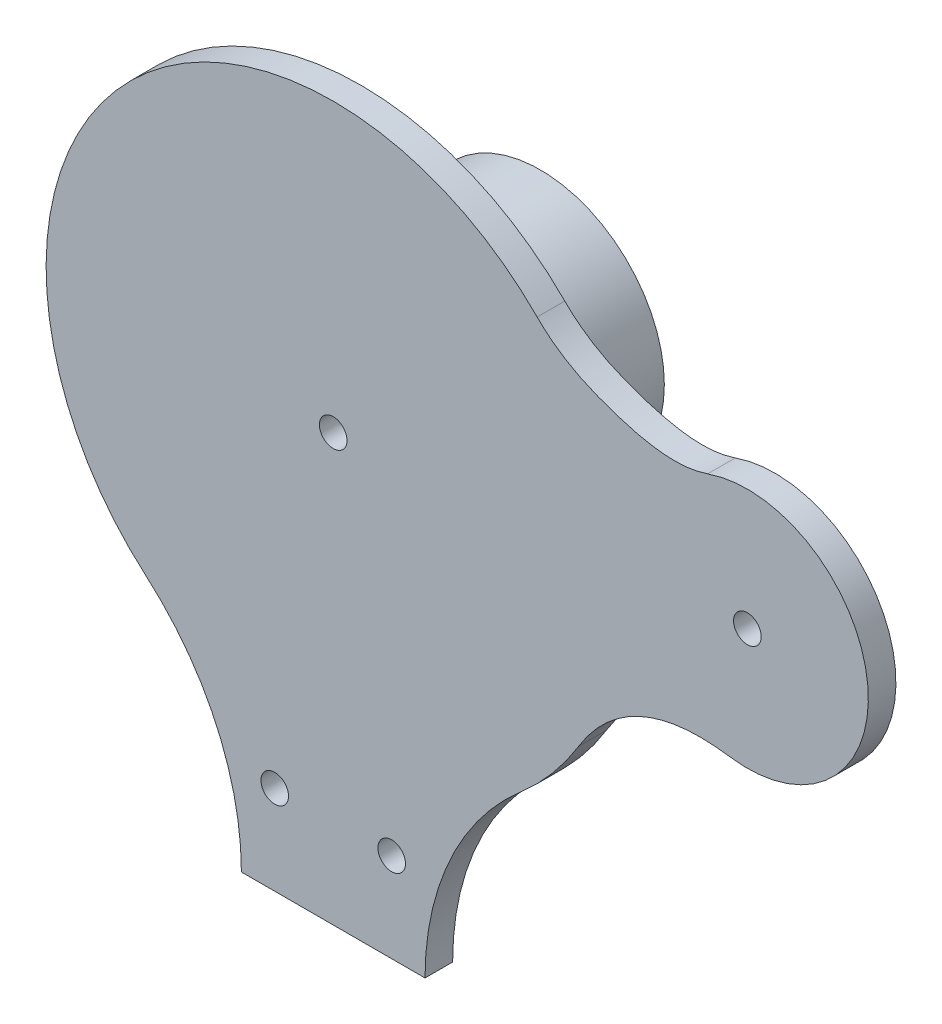
ISO-10303-21;
HEADER;
FILE_DESCRIPTION(('STEP AP214'),'2;1');
FILE_NAME('part.step','',(''),(''),'','','');
FILE_SCHEMA(('AUTOMOTIVE_DESIGN { 1 0 10303 214 1 1 1 1 }'));
ENDSEC;
DATA;
#1=APPLICATION_CONTEXT('core data for automotive mechanical design processes');
#2=APPLICATION_PROTOCOL_DEFINITION('international standard','automotive_design',2000,#1);
#3=PRODUCT_CONTEXT('',#1,'mechanical');
#4=PRODUCT('Part','Part','',(#3));
#5=PRODUCT_RELATED_PRODUCT_CATEGORY('part','',(#4));
#6=PRODUCT_DEFINITION_FORMATION('','',#4);
#7=PRODUCT_DEFINITION_CONTEXT('part definition',#1,'design');
#8=PRODUCT_DEFINITION('design','',#6,#7);
#9=PRODUCT_DEFINITION_SHAPE('','',#8);
#10=(LENGTH_UNIT() NAMED_UNIT(*) SI_UNIT(.MILLI.,.METRE.));
#11=(NAMED_UNIT(*) PLANE_ANGLE_UNIT() SI_UNIT($,.RADIAN.));
#12=(NAMED_UNIT(*) SI_UNIT($,.STERADIAN.) SOLID_ANGLE_UNIT());
#13=UNCERTAINTY_MEASURE_WITH_UNIT(LENGTH_MEASURE(1.E-05),#10,'distance_accuracy_value','');
#14=(GEOMETRIC_REPRESENTATION_CONTEXT(3) GLOBAL_UNCERTAINTY_ASSIGNED_CONTEXT((#13)) GLOBAL_UNIT_ASSIGNED_CONTEXT((#10,
#11,#12)) REPRESENTATION_CONTEXT('',''));
#15=CARTESIAN_POINT('',(0.,0.,0.));
#16=DIRECTION('',(0.,0.,1.));
#17=DIRECTION('',(1.,0.,0.));
#18=AXIS2_PLACEMENT_3D('',#15,#16,#17);
#19=CARTESIAN_POINT('',(0.,-52.8237291338587,5.08));
#20=DIRECTION('',(0.,0.,-1.));
#21=DIRECTION('',(-1.,0.,0.));
#22=AXIS2_PLACEMENT_3D('',#19,#20,#21);
#23=CYLINDRICAL_SURFACE('',#22,52.8237291338587);
#24=DIRECTION('',(0.,0.,1.));
#25=VECTOR('',#24,1.);
#26=CARTESIAN_POINT('',(37.5245833339332,-15.6450792764207,-88.7850163484781));
#27=LINE('',#26,#25);
#28=CARTESIAN_POINT('',(37.5245833339332,-15.6450792764207,0.));
#29=VERTEX_POINT('',#28);
#30=CARTESIAN_POINT('',(37.5245833339332,-15.6450792764207,5.08));
#31=VERTEX_POINT('',#30);
#32=EDGE_CURVE('E147',#29,#31,#27,.T.);
#33=ORIENTED_EDGE('',*,*,#32,.F.);
#34=CARTESIAN_POINT('',(0.,-52.8237291338587,0.));
#35=DIRECTION('',(0.,0.,1.));
#36=DIRECTION('',(1.,0.,0.));
#37=AXIS2_PLACEMENT_3D('',#34,#35,#36);
#38=CIRCLE('',#37,52.8237291338587);
#39=CARTESIAN_POINT('',(-34.5064888002731,-92.819336271192,0.));
#40=VERTEX_POINT('',#39);
#41=EDGE_CURVE('E187',#29,#40,#38,.T.);
#42=ORIENTED_EDGE('',*,*,#41,.T.);
#43=DIRECTION('',(0.,0.,-1.));
#44=VECTOR('',#43,1.);
#45=CARTESIAN_POINT('',(-34.5064888002731,-92.819336271192,5.08));
#46=LINE('',#45,#44);
#47=CARTESIAN_POINT('',(-34.5064888002731,-92.819336271192,5.08));
#48=VERTEX_POINT('',#47);
#49=EDGE_CURVE('E182',#48,#40,#46,.T.);
#50=ORIENTED_EDGE('',*,*,#49,.F.);
#51=CARTESIAN_POINT('',(0.,-52.8237291338587,5.08));
#52=DIRECTION('',(0.,0.,1.));
#53=DIRECTION('',(1.,0.,0.));
#54=AXIS2_PLACEMENT_3D('',#51,#52,#53);
#55=CIRCLE('',#54,52.8237291338587);
#56=EDGE_CURVE('E48',#31,#48,#55,.T.);
#57=ORIENTED_EDGE('',*,*,#56,.F.);
#58=EDGE_LOOP('',(#33,#42,#50,#57));
#59=FACE_BOUND('',#58,.T.);
#60=ADVANCED_FACE('F32',(#59),#23,.T.);
#61=CARTESIAN_POINT('',(-67.691,-131.282672273614,5.08));
#62=DIRECTION('',(0.,0.,1.));
#63=DIRECTION('',(1.,0.,0.));
#64=AXIS2_PLACEMENT_3D('',#61,#62,#63);
#65=PLANE('',#64);
#66=CARTESIAN_POINT('',(76.2,-45.9724694607301,5.08));
#67=DIRECTION('',(0.,0.,1.));
#68=DIRECTION('',(1.,0.,0.));
#69=AXIS2_PLACEMENT_3D('',#66,#67,#68);
#70=CIRCLE('',#69,2.54);
#71=CARTESIAN_POINT('',(78.74,-45.9724694607301,5.08));
#72=VERTEX_POINT('',#71);
#73=EDGE_CURVE('E127',#72,#72,#70,.T.);
#74=ORIENTED_EDGE('',*,*,#73,.F.);
#75=EDGE_LOOP('',(#74));
#76=FACE_BOUND('',#75,.T.);
#77=CARTESIAN_POINT('',(-1.22818422099158E-12,-52.8237291338587,5.08));
#78=DIRECTION('',(0.,0.,-1.));
#79=DIRECTION('',(-1.,0.,0.));
#80=AXIS2_PLACEMENT_3D('',#77,#78,#79);
#81=CIRCLE('',#80,2.54);
#82=CARTESIAN_POINT('',(-2.54000000000123,-52.8237291338587,5.08));
#83=VERTEX_POINT('',#82);
#84=EDGE_CURVE('E153',#83,#83,#81,.T.);
#85=ORIENTED_EDGE('',*,*,#84,.T.);
#86=EDGE_LOOP('',(#85));
#87=FACE_BOUND('',#86,.T.);
#88=CARTESIAN_POINT('',(-10.7564051785917,-114.872047192808,5.08));
#89=DIRECTION('',(0.,0.,1.));
#90=DIRECTION('',(1.,0.,0.));
#91=AXIS2_PLACEMENT_3D('',#88,#89,#90);
#92=CIRCLE('',#91,2.54);
#93=CARTESIAN_POINT('',(-8.2164051785917,-114.872047192808,5.08));
#94=VERTEX_POINT('',#93);
#95=EDGE_CURVE('E168',#94,#94,#92,.T.);
#96=ORIENTED_EDGE('',*,*,#95,.F.);
#97=EDGE_LOOP('',(#96));
#98=FACE_BOUND('',#97,.T.);
#99=CARTESIAN_POINT('',(-67.691,-131.282672273614,5.08));
#100=DIRECTION('',(0.,0.,-1.));
#101=DIRECTION('',(1.,0.,0.));
#102=AXIS2_PLACEMENT_3D('',#99,#100,#101);
#103=CIRCLE('',#102,50.8);
#104=CARTESIAN_POINT('',(-16.891,-131.282672273614,5.08));
#105=VERTEX_POINT('',#104);
#106=EDGE_CURVE('E174',#48,#105,#103,.T.);
#107=ORIENTED_EDGE('',*,*,#106,.T.);
#108=DIRECTION('',(1.,0.,0.));
#109=VECTOR('',#108,1.);
#110=CARTESIAN_POINT('',(-16.891,-131.282672273614,5.08));
#111=LINE('',#110,#109);
#112=CARTESIAN_POINT('',(16.891,-131.282672273614,5.08));
#113=VERTEX_POINT('',#112);
#114=EDGE_CURVE('E176',#105,#113,#111,.T.);
#115=ORIENTED_EDGE('',*,*,#114,.T.);
#116=CARTESIAN_POINT('',(67.691,-131.282672273614,5.08));
#117=DIRECTION('',(0.,0.,-1.));
#118=DIRECTION('',(1.,0.,0.));
#119=AXIS2_PLACEMENT_3D('',#116,#117,#118);
#120=CIRCLE('',#119,50.8);
#121=CARTESIAN_POINT('',(34.5064888002731,-92.819336271192,5.08));
#122=VERTEX_POINT('',#121);
#123=EDGE_CURVE('E179',#113,#122,#120,.T.);
#124=ORIENTED_EDGE('',*,*,#123,.T.);
#125=CARTESIAN_POINT('',(45.1618112271935,-80.2236774237117,5.08));
#126=VERTEX_POINT('',#125);
#127=EDGE_CURVE('E124',#122,#126,#55,.T.);
#128=ORIENTED_EDGE('',*,*,#127,.T.);
#129=CARTESIAN_POINT('',(45.1618112271935,-80.2236774237117,5.08));
#130=CARTESIAN_POINT('',(47.5743131665912,-76.2472846210777,5.08));
#131=CARTESIAN_POINT('',(55.0333885756071,-68.6406887311446,5.08));
#132=CARTESIAN_POINT('',(65.5082150756756,-66.9035385878799,5.08));
#133=CARTESIAN_POINT('',(72.9914132998963,-67.9938641825907,5.08));
#134=B_SPLINE_CURVE_WITH_KNOTS('',3,(#129,#130,#131,#132,#133),.UNSPECIFIED.,.F.,.F.,(4,1,4),
(0.,0.395495140914109,1.),.UNSPECIFIED.);
#135=CARTESIAN_POINT('',(72.9914132998962,-67.9938641825907,5.08));
#136=VERTEX_POINT('',#135);
#137=EDGE_CURVE('E105',#126,#136,#134,.T.);
#138=ORIENTED_EDGE('',*,*,#137,.T.);
#139=CARTESIAN_POINT('',(76.2,-45.9724694607301,5.08));
#140=DIRECTION('',(0.,0.,1.));
#141=DIRECTION('',(1.,0.,0.));
#142=AXIS2_PLACEMENT_3D('',#139,#140,#141);
#143=CIRCLE('',#142,22.2539177249327);
#144=CARTESIAN_POINT('',(68.9001800028994,-24.9498748987355,5.08));
#145=VERTEX_POINT('',#144);
#146=EDGE_CURVE('E114',#136,#145,#143,.T.);
#147=ORIENTED_EDGE('',*,*,#146,.T.);
#148=CARTESIAN_POINT('',(68.9001800028994,-24.9498748987355,5.08));
#149=CARTESIAN_POINT('',(63.2971972314928,-26.8954371154976,5.08));
#150=CARTESIAN_POINT('',(51.3897080482479,-24.415182371124,5.08));
#151=CARTESIAN_POINT('',(41.5692824440602,-19.7274128038788,5.08));
#152=CARTESIAN_POINT('',(37.5245833339332,-15.6450792764207,5.08));
#153=B_SPLINE_CURVE_WITH_KNOTS('',3,(#148,#149,#150,#151,#152),.UNSPECIFIED.,.F.,.F.,(4,1,4),
(0.,0.520070066682019,1.),.UNSPECIFIED.);
#154=EDGE_CURVE('E111',#145,#31,#153,.T.);
#155=ORIENTED_EDGE('',*,*,#154,.T.);
#156=ORIENTED_EDGE('',*,*,#56,.T.);
#157=EDGE_LOOP('',(#107,#115,#124,#128,#138,#147,#155,#156));
#158=FACE_BOUND('',#157,.T.);
#159=CARTESIAN_POINT('',(10.7564051785917,-114.872047192808,5.08));
#160=DIRECTION('',(0.,0.,1.));
#161=DIRECTION('',(1.,0.,0.));
#162=AXIS2_PLACEMENT_3D('',#159,#160,#161);
#163=CIRCLE('',#162,2.53999999999999);
#164=CARTESIAN_POINT('',(13.2964051785917,-114.872047192808,5.08));
#165=VERTEX_POINT('',#164);
#166=EDGE_CURVE('E162',#165,#165,#163,.T.);
#167=ORIENTED_EDGE('',*,*,#166,.F.);
#168=EDGE_LOOP('',(#167));
#169=FACE_BOUND('',#168,.T.);
#170=ADVANCED_FACE('F122',(#76,#87,#98,#158,#169),#65,.T.);
#171=CARTESIAN_POINT('',(-67.691,-131.282672273614,0.));
#172=DIRECTION('',(0.,0.,1.));
#173=DIRECTION('',(1.,0.,0.));
#174=AXIS2_PLACEMENT_3D('',#171,#172,#173);
#175=PLANE('',#174);
#176=CARTESIAN_POINT('',(76.2,-45.9724694607301,0.));
#177=DIRECTION('',(0.,0.,1.));
#178=DIRECTION('',(1.,0.,0.));
#179=AXIS2_PLACEMENT_3D('',#176,#177,#178);
#180=CIRCLE('',#179,2.54);
#181=CARTESIAN_POINT('',(78.74,-45.9724694607301,0.));
#182=VERTEX_POINT('',#181);
#183=EDGE_CURVE('E36',#182,#182,#180,.T.);
#184=ORIENTED_EDGE('',*,*,#183,.T.);
#185=EDGE_LOOP('',(#184));
#186=FACE_BOUND('',#185,.T.);
#187=CARTESIAN_POINT('',(-1.22818422099158E-12,-52.8237291338587,0.));
#188=DIRECTION('',(0.,0.,1.));
#189=DIRECTION('',(1.,0.,0.));
#190=AXIS2_PLACEMENT_3D('',#187,#188,#189);
#191=CIRCLE('',#190,22.8255294525079);
#192=CARTESIAN_POINT('',(22.8255294525067,-52.8237291338587,0.));
#193=VERTEX_POINT('',#192);
#194=EDGE_CURVE('E11',#193,#193,#191,.F.);
#195=ORIENTED_EDGE('',*,*,#194,.F.);
#196=EDGE_LOOP('',(#195));
#197=FACE_BOUND('',#196,.T.);
#198=DIRECTION('',(1.,0.,0.));
#199=VECTOR('',#198,1.);
#200=CARTESIAN_POINT('',(-16.891,-131.282672273614,0.));
#201=LINE('',#200,#199);
#202=CARTESIAN_POINT('',(-16.891,-131.282672273614,0.));
#203=VERTEX_POINT('',#202);
#204=CARTESIAN_POINT('',(16.891,-131.282672273614,0.));
#205=VERTEX_POINT('',#204);
#206=EDGE_CURVE('E171',#203,#205,#201,.T.);
#207=ORIENTED_EDGE('',*,*,#206,.F.);
#208=CARTESIAN_POINT('',(-67.691,-131.282672273614,0.));
#209=DIRECTION('',(0.,0.,-1.));
#210=DIRECTION('',(1.,0.,0.));
#211=AXIS2_PLACEMENT_3D('',#208,#209,#210);
#212=CIRCLE('',#211,50.8);
#213=EDGE_CURVE('E177',#40,#203,#212,.T.);
#214=ORIENTED_EDGE('',*,*,#213,.F.);
#215=ORIENTED_EDGE('',*,*,#41,.F.);
#216=CARTESIAN_POINT('',(68.9001800028994,-24.9498748987355,0.));
#217=CARTESIAN_POINT('',(63.2971972314928,-26.8954371154976,0.));
#218=CARTESIAN_POINT('',(51.3897080482479,-24.415182371124,0.));
#219=CARTESIAN_POINT('',(41.5692824440602,-19.7274128038788,0.));
#220=CARTESIAN_POINT('',(37.5245833339332,-15.6450792764207,0.));
#221=B_SPLINE_CURVE_WITH_KNOTS('',3,(#216,#217,#218,#219,#220),.UNSPECIFIED.,.F.,.F.,(4,1,4),
(0.,0.520070066682019,1.),.UNSPECIFIED.);
#222=CARTESIAN_POINT('',(68.9001800028994,-24.9498748987355,0.));
#223=VERTEX_POINT('',#222);
#224=EDGE_CURVE('E146',#29,#223,#221,.F.);
#225=ORIENTED_EDGE('',*,*,#224,.T.);
#226=CARTESIAN_POINT('',(76.2,-45.9724694607301,0.));
#227=DIRECTION('',(0.,0.,1.));
#228=DIRECTION('',(1.,0.,0.));
#229=AXIS2_PLACEMENT_3D('',#226,#227,#228);
#230=CIRCLE('',#229,22.2539177249327);
#231=CARTESIAN_POINT('',(72.9914132998962,-67.9938641825907,0.));
#232=VERTEX_POINT('',#231);
#233=EDGE_CURVE('E150',#223,#232,#230,.F.);
#234=ORIENTED_EDGE('',*,*,#233,.T.);
#235=CARTESIAN_POINT('',(45.1618112271935,-80.2236774237117,0.));
#236=CARTESIAN_POINT('',(47.5743131665912,-76.2472846210777,0.));
#237=CARTESIAN_POINT('',(55.0333885756071,-68.6406887311446,0.));
#238=CARTESIAN_POINT('',(65.5082150756756,-66.9035385878799,0.));
#239=CARTESIAN_POINT('',(72.9914132998963,-67.9938641825907,0.));
#240=B_SPLINE_CURVE_WITH_KNOTS('',3,(#235,#236,#237,#238,#239),.UNSPECIFIED.,.F.,.F.,(4,1,4),
(0.,0.395495140914109,1.),.UNSPECIFIED.);
#241=CARTESIAN_POINT('',(45.1618112271935,-80.2236774237117,0.));
#242=VERTEX_POINT('',#241);
#243=EDGE_CURVE('E107',#232,#242,#240,.F.);
#244=ORIENTED_EDGE('',*,*,#243,.T.);
#245=CARTESIAN_POINT('',(34.5064888002731,-92.819336271192,0.));
#246=VERTEX_POINT('',#245);
#247=EDGE_CURVE('E188',#246,#242,#38,.T.);
#248=ORIENTED_EDGE('',*,*,#247,.F.);
#249=CARTESIAN_POINT('',(67.691,-131.282672273614,0.));
#250=DIRECTION('',(0.,0.,-1.));
#251=DIRECTION('',(1.,0.,0.));
#252=AXIS2_PLACEMENT_3D('',#249,#250,#251);
#253=CIRCLE('',#252,50.8);
#254=EDGE_CURVE('E185',#205,#246,#253,.T.);
#255=ORIENTED_EDGE('',*,*,#254,.F.);
#256=EDGE_LOOP('',(#207,#214,#215,#225,#234,#244,#248,#255));
#257=FACE_BOUND('',#256,.T.);
#258=CARTESIAN_POINT('',(-10.7564051785917,-114.872047192808,0.));
#259=DIRECTION('',(0.,0.,1.));
#260=DIRECTION('',(1.,0.,0.));
#261=AXIS2_PLACEMENT_3D('',#258,#259,#260);
#262=CIRCLE('',#261,2.54);
#263=CARTESIAN_POINT('',(-8.2164051785917,-114.872047192808,0.));
#264=VERTEX_POINT('',#263);
#265=EDGE_CURVE('E165',#264,#264,#262,.T.);
#266=ORIENTED_EDGE('',*,*,#265,.T.);
#267=EDGE_LOOP('',(#266));
#268=FACE_BOUND('',#267,.T.);
#269=CARTESIAN_POINT('',(10.7564051785917,-114.872047192808,0.));
#270=DIRECTION('',(0.,0.,1.));
#271=DIRECTION('',(1.,0.,0.));
#272=AXIS2_PLACEMENT_3D('',#269,#270,#271);
#273=CIRCLE('',#272,2.53999999999999);
#274=CARTESIAN_POINT('',(13.2964051785917,-114.872047192808,0.));
#275=VERTEX_POINT('',#274);
#276=EDGE_CURVE('E161',#275,#275,#273,.T.);
#277=ORIENTED_EDGE('',*,*,#276,.T.);
#278=EDGE_LOOP('',(#277));
#279=FACE_BOUND('',#278,.T.);
#280=ADVANCED_FACE('F209',(#186,#197,#257,#268,#279),#175,.F.);
#281=CARTESIAN_POINT('',(-16.891,-131.282672273614,5.08));
#282=DIRECTION('',(0.,1.,0.));
#283=DIRECTION('',(-1.,0.,0.));
#284=AXIS2_PLACEMENT_3D('',#281,#282,#283);
#285=PLANE('',#284);
#286=ORIENTED_EDGE('',*,*,#206,.T.);
#287=DIRECTION('',(0.,0.,-1.));
#288=VECTOR('',#287,1.);
#289=CARTESIAN_POINT('',(16.891,-131.282672273614,5.08));
#290=LINE('',#289,#288);
#291=EDGE_CURVE('E196',#113,#205,#290,.T.);
#292=ORIENTED_EDGE('',*,*,#291,.F.);
#293=ORIENTED_EDGE('',*,*,#114,.F.);
#294=DIRECTION('',(0.,0.,-1.));
#295=VECTOR('',#294,1.);
#296=CARTESIAN_POINT('',(-16.891,-131.282672273614,5.08));
#297=LINE('',#296,#295);
#298=EDGE_CURVE('E41',#105,#203,#297,.T.);
#299=ORIENTED_EDGE('',*,*,#298,.T.);
#300=EDGE_LOOP('',(#286,#292,#293,#299));
#301=FACE_BOUND('',#300,.T.);
#302=ADVANCED_FACE('F34',(#301),#285,.F.);
#303=CARTESIAN_POINT('',(67.691,-131.282672273614,5.08));
#304=DIRECTION('',(0.,0.,-1.));
#305=DIRECTION('',(-1.,0.,0.));
#306=AXIS2_PLACEMENT_3D('',#303,#304,#305);
#307=CYLINDRICAL_SURFACE('',#306,50.8);
#308=ORIENTED_EDGE('',*,*,#254,.T.);
#309=DIRECTION('',(0.,0.,-1.));
#310=VECTOR('',#309,1.);
#311=CARTESIAN_POINT('',(34.5064888002731,-92.819336271192,5.08));
#312=LINE('',#311,#310);
#313=EDGE_CURVE('E193',#122,#246,#312,.T.);
#314=ORIENTED_EDGE('',*,*,#313,.F.);
#315=ORIENTED_EDGE('',*,*,#123,.F.);
#316=ORIENTED_EDGE('',*,*,#291,.T.);
#317=EDGE_LOOP('',(#308,#314,#315,#316));
#318=FACE_BOUND('',#317,.T.);
#319=ADVANCED_FACE('F214',(#318),#307,.F.);
#320=ORIENTED_EDGE('',*,*,#247,.T.);
#321=DIRECTION('',(0.,0.,1.));
#322=VECTOR('',#321,1.);
#323=CARTESIAN_POINT('',(45.1618112271935,-80.2236774237117,-88.7850163484781));
#324=LINE('',#323,#322);
#325=EDGE_CURVE('E56',#242,#126,#324,.T.);
#326=ORIENTED_EDGE('',*,*,#325,.T.);
#327=ORIENTED_EDGE('',*,*,#127,.F.);
#328=ORIENTED_EDGE('',*,*,#313,.T.);
#329=EDGE_LOOP('',(#320,#326,#327,#328));
#330=FACE_BOUND('',#329,.T.);
#331=ADVANCED_FACE('F216',(#330),#23,.T.);
#332=CARTESIAN_POINT('',(-67.691,-131.282672273614,5.08));
#333=DIRECTION('',(0.,0.,-1.));
#334=DIRECTION('',(-1.,0.,0.));
#335=AXIS2_PLACEMENT_3D('',#332,#333,#334);
#336=CYLINDRICAL_SURFACE('',#335,50.8);
#337=ORIENTED_EDGE('',*,*,#213,.T.);
#338=ORIENTED_EDGE('',*,*,#298,.F.);
#339=ORIENTED_EDGE('',*,*,#106,.F.);
#340=ORIENTED_EDGE('',*,*,#49,.T.);
#341=EDGE_LOOP('',(#337,#338,#339,#340));
#342=FACE_BOUND('',#341,.T.);
#343=ADVANCED_FACE('F206',(#342),#336,.F.);
#344=CARTESIAN_POINT('',(-10.7564051785917,-114.872047192808,5.08));
#345=DIRECTION('',(0.,0.,-1.));
#346=DIRECTION('',(-1.,0.,0.));
#347=AXIS2_PLACEMENT_3D('',#344,#345,#346);
#348=CYLINDRICAL_SURFACE('',#347,2.54);
#349=ORIENTED_EDGE('',*,*,#95,.T.);
#350=EDGE_LOOP('',(#349));
#351=FACE_BOUND('',#350,.T.);
#352=ORIENTED_EDGE('',*,*,#265,.F.);
#353=EDGE_LOOP('',(#352));
#354=FACE_BOUND('',#353,.T.);
#355=ADVANCED_FACE('F254',(#351,#354),#348,.F.);
#356=CARTESIAN_POINT('',(10.7564051785917,-114.872047192808,5.08));
#357=DIRECTION('',(0.,0.,-1.));
#358=DIRECTION('',(-1.,0.,0.));
#359=AXIS2_PLACEMENT_3D('',#356,#357,#358);
#360=CYLINDRICAL_SURFACE('',#359,2.53999999999999);
#361=ORIENTED_EDGE('',*,*,#166,.T.);
#362=EDGE_LOOP('',(#361));
#363=FACE_BOUND('',#362,.T.);
#364=ORIENTED_EDGE('',*,*,#276,.F.);
#365=EDGE_LOOP('',(#364));
#366=FACE_BOUND('',#365,.T.);
#367=ADVANCED_FACE('F250',(#363,#366),#360,.F.);
#368=CARTESIAN_POINT('',(-1.22818422099158E-12,-52.8237291338587,-33.02));
#369=DIRECTION('',(0.,0.,1.));
#370=DIRECTION('',(1.,0.,0.));
#371=AXIS2_PLACEMENT_3D('',#368,#369,#370);
#372=CYLINDRICAL_SURFACE('',#371,22.8255294525079);
#373=CARTESIAN_POINT('',(-1.22818422099158E-12,-52.8237291338587,-33.02));
#374=DIRECTION('',(0.,0.,-1.));
#375=DIRECTION('',(-1.,0.,0.));
#376=AXIS2_PLACEMENT_3D('',#373,#374,#375);
#377=CIRCLE('',#376,22.8255294525079);
#378=CARTESIAN_POINT('',(-22.8255294525091,-52.8237291338587,-33.02));
#379=VERTEX_POINT('',#378);
#380=EDGE_CURVE('E156',#379,#379,#377,.T.);
#381=ORIENTED_EDGE('',*,*,#380,.F.);
#382=EDGE_LOOP('',(#381));
#383=FACE_BOUND('',#382,.T.);
#384=ORIENTED_EDGE('',*,*,#194,.T.);
#385=EDGE_LOOP('',(#384));
#386=FACE_BOUND('',#385,.T.);
#387=ADVANCED_FACE('F246',(#383,#386),#372,.T.);
#388=CARTESIAN_POINT('',(-1.22818422099158E-12,-52.8237291338587,-33.02));
#389=DIRECTION('',(0.,0.,-1.));
#390=DIRECTION('',(-1.,0.,0.));
#391=AXIS2_PLACEMENT_3D('',#388,#389,#390);
#392=PLANE('',#391);
#393=CARTESIAN_POINT('',(-1.22818422099158E-12,-52.8237291338587,-33.02));
#394=DIRECTION('',(0.,0.,-1.));
#395=DIRECTION('',(-1.,0.,0.));
#396=AXIS2_PLACEMENT_3D('',#393,#394,#395);
#397=CIRCLE('',#396,2.54);
#398=CARTESIAN_POINT('',(-2.54000000000123,-52.8237291338587,-33.02));
#399=VERTEX_POINT('',#398);
#400=EDGE_CURVE('E152',#399,#399,#397,.T.);
#401=ORIENTED_EDGE('',*,*,#400,.F.);
#402=EDGE_LOOP('',(#401));
#403=FACE_BOUND('',#402,.T.);
#404=ORIENTED_EDGE('',*,*,#380,.T.);
#405=EDGE_LOOP('',(#404));
#406=FACE_BOUND('',#405,.T.);
#407=ADVANCED_FACE('F242',(#403,#406),#392,.T.);
#408=CARTESIAN_POINT('',(-1.22818422099158E-12,-52.8237291338587,5.08));
#409=DIRECTION('',(0.,0.,-1.));
#410=DIRECTION('',(-1.,0.,0.));
#411=AXIS2_PLACEMENT_3D('',#408,#409,#410);
#412=CYLINDRICAL_SURFACE('',#411,2.54);
#413=ORIENTED_EDGE('',*,*,#84,.F.);
#414=EDGE_LOOP('',(#413));
#415=FACE_BOUND('',#414,.T.);
#416=ORIENTED_EDGE('',*,*,#400,.T.);
#417=EDGE_LOOP('',(#416));
#418=FACE_BOUND('',#417,.T.);
#419=ADVANCED_FACE('F238',(#415,#418),#412,.F.);
#420=CARTESIAN_POINT('',(45.1618112271935,-80.2236774237117,-88.7850163484781));
#421=CARTESIAN_POINT('',(47.5743131665912,-76.2472846210777,-88.7850163484781));
#422=CARTESIAN_POINT('',(55.0333885756071,-68.6406887311446,-88.7850163484781));
#423=CARTESIAN_POINT('',(65.5082150756756,-66.9035385878799,-88.7850163484781));
#424=CARTESIAN_POINT('',(72.9914132998963,-67.9938641825907,-88.7850163484781));
#425=B_SPLINE_CURVE_WITH_KNOTS('',3,(#420,#421,#422,#423,#424),.UNSPECIFIED.,.F.,.F.,(4,1,4),
(0.,0.395495140914109,1.),.UNSPECIFIED.);
#426=DIRECTION('',(0.,0.,1.));
#427=VECTOR('',#426,1.);
#428=SURFACE_OF_LINEAR_EXTRUSION('',#425,#427);
#429=ORIENTED_EDGE('',*,*,#243,.F.);
#430=DIRECTION('',(0.,0.,1.));
#431=VECTOR('',#430,1.);
#432=CARTESIAN_POINT('',(72.9914132998962,-67.9938641825907,-88.7850163484781));
#433=LINE('',#432,#431);
#434=EDGE_CURVE('E101',#232,#136,#433,.T.);
#435=ORIENTED_EDGE('',*,*,#434,.T.);
#436=ORIENTED_EDGE('',*,*,#137,.F.);
#437=ORIENTED_EDGE('',*,*,#325,.F.);
#438=EDGE_LOOP('',(#429,#435,#436,#437));
#439=FACE_BOUND('',#438,.T.);
#440=ADVANCED_FACE('F103',(#439),#428,.T.);
#441=CARTESIAN_POINT('',(68.9001800028994,-24.9498748987355,-88.7850163484781));
#442=CARTESIAN_POINT('',(63.2971972314928,-26.8954371154976,-88.7850163484781));
#443=CARTESIAN_POINT('',(51.3897080482479,-24.415182371124,-88.7850163484781));
#444=CARTESIAN_POINT('',(41.5692824440602,-19.7274128038788,-88.7850163484781));
#445=CARTESIAN_POINT('',(37.5245833339332,-15.6450792764207,-88.7850163484781));
#446=B_SPLINE_CURVE_WITH_KNOTS('',3,(#441,#442,#443,#444,#445),.UNSPECIFIED.,.F.,.F.,(4,1,4),
(0.,0.520070066682019,1.),.UNSPECIFIED.);
#447=DIRECTION('',(0.,0.,1.));
#448=VECTOR('',#447,1.);
#449=SURFACE_OF_LINEAR_EXTRUSION('',#446,#448);
#450=ORIENTED_EDGE('',*,*,#224,.F.);
#451=ORIENTED_EDGE('',*,*,#32,.T.);
#452=ORIENTED_EDGE('',*,*,#154,.F.);
#453=DIRECTION('',(0.,0.,1.));
#454=VECTOR('',#453,1.);
#455=CARTESIAN_POINT('',(68.9001800028994,-24.9498748987355,-88.7850163484781));
#456=LINE('',#455,#454);
#457=EDGE_CURVE('E110',#223,#145,#456,.T.);
#458=ORIENTED_EDGE('',*,*,#457,.F.);
#459=EDGE_LOOP('',(#450,#451,#452,#458));
#460=FACE_BOUND('',#459,.T.);
#461=ADVANCED_FACE('F237',(#460),#449,.T.);
#462=CARTESIAN_POINT('',(76.2,-45.9724694607301,-88.7850163484781));
#463=DIRECTION('',(0.,0.,1.));
#464=DIRECTION('',(1.,0.,0.));
#465=AXIS2_PLACEMENT_3D('',#462,#463,#464);
#466=CYLINDRICAL_SURFACE('',#465,22.2539177249327);
#467=ORIENTED_EDGE('',*,*,#233,.F.);
#468=ORIENTED_EDGE('',*,*,#457,.T.);
#469=ORIENTED_EDGE('',*,*,#146,.F.);
#470=ORIENTED_EDGE('',*,*,#434,.F.);
#471=EDGE_LOOP('',(#467,#468,#469,#470));
#472=FACE_BOUND('',#471,.T.);
#473=ADVANCED_FACE('F115',(#472),#466,.T.);
#474=CARTESIAN_POINT('',(76.2,-45.9724694607301,-33.02));
#475=DIRECTION('',(0.,0.,1.));
#476=DIRECTION('',(1.,0.,0.));
#477=AXIS2_PLACEMENT_3D('',#474,#475,#476);
#478=CYLINDRICAL_SURFACE('',#477,2.54);
#479=ORIENTED_EDGE('',*,*,#73,.T.);
#480=EDGE_LOOP('',(#479));
#481=FACE_BOUND('',#480,.T.);
#482=ORIENTED_EDGE('',*,*,#183,.F.);
#483=EDGE_LOOP('',(#482));
#484=FACE_BOUND('',#483,.T.);
#485=ADVANCED_FACE('F281',(#481,#484),#478,.F.);
#486=CLOSED_SHELL('',(#60,#170,#280,#302,#319,#331,#343,#355,#367,#387,#407,#419,#440,#461,#473,#485));
#487=MANIFOLD_SOLID_BREP('B2',#486);
#488=ADVANCED_BREP_SHAPE_REPRESENTATION('',(#18,#487),#14);
#489=SHAPE_DEFINITION_REPRESENTATION(#9,#488);
ENDSEC;
END-ISO-10303-21;
